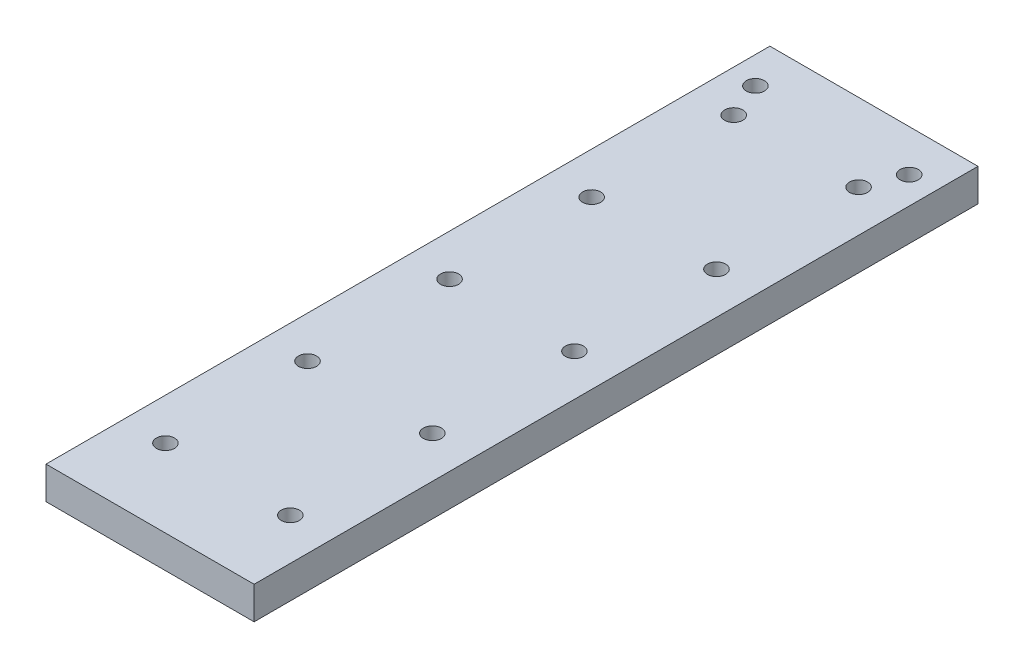
ISO-10303-21;
HEADER;
FILE_DESCRIPTION(('STEP AP214'),'2;1');
FILE_NAME('part.step','',(''),(''),'','','');
FILE_SCHEMA(('AUTOMOTIVE_DESIGN { 1 0 10303 214 1 1 1 1 }'));
ENDSEC;
DATA;
#1=APPLICATION_CONTEXT('core data for automotive mechanical design processes');
#2=APPLICATION_PROTOCOL_DEFINITION('international standard','automotive_design',2000,#1);
#3=PRODUCT_CONTEXT('',#1,'mechanical');
#4=PRODUCT('Part','Part','',(#3));
#5=PRODUCT_RELATED_PRODUCT_CATEGORY('part','',(#4));
#6=PRODUCT_DEFINITION_FORMATION('','',#4);
#7=PRODUCT_DEFINITION_CONTEXT('part definition',#1,'design');
#8=PRODUCT_DEFINITION('design','',#6,#7);
#9=PRODUCT_DEFINITION_SHAPE('','',#8);
#10=(LENGTH_UNIT() NAMED_UNIT(*) SI_UNIT(.MILLI.,.METRE.));
#11=(NAMED_UNIT(*) PLANE_ANGLE_UNIT() SI_UNIT($,.RADIAN.));
#12=(NAMED_UNIT(*) SI_UNIT($,.STERADIAN.) SOLID_ANGLE_UNIT());
#13=UNCERTAINTY_MEASURE_WITH_UNIT(LENGTH_MEASURE(1.E-05),#10,'distance_accuracy_value','');
#14=(GEOMETRIC_REPRESENTATION_CONTEXT(3) GLOBAL_UNCERTAINTY_ASSIGNED_CONTEXT((#13)) GLOBAL_UNIT_ASSIGNED_CONTEXT((#10,
#11,#12)) REPRESENTATION_CONTEXT('',''));
#15=CARTESIAN_POINT('',(0.,0.,0.));
#16=DIRECTION('',(0.,0.,1.));
#17=DIRECTION('',(1.,0.,0.));
#18=AXIS2_PLACEMENT_3D('',#15,#16,#17);
#19=CARTESIAN_POINT('',(57.5,18.,200.));
#20=DIRECTION('',(-1.,0.,0.));
#21=DIRECTION('',(0.,0.,1.));
#22=AXIS2_PLACEMENT_3D('',#19,#20,#21);
#23=PLANE('',#22);
#24=DIRECTION('',(0.,0.,-1.));
#25=VECTOR('',#24,1.);
#26=CARTESIAN_POINT('',(57.5,0.,200.));
#27=LINE('',#26,#25);
#28=CARTESIAN_POINT('',(57.5,0.,200.));
#29=VERTEX_POINT('',#28);
#30=CARTESIAN_POINT('',(57.5,0.,-200.));
#31=VERTEX_POINT('',#30);
#32=EDGE_CURVE('E97',#29,#31,#27,.T.);
#33=ORIENTED_EDGE('',*,*,#32,.T.);
#34=DIRECTION('',(0.,-1.,0.));
#35=VECTOR('',#34,1.);
#36=CARTESIAN_POINT('',(57.5,18.,-200.));
#37=LINE('',#36,#35);
#38=CARTESIAN_POINT('',(57.5,18.,-200.));
#39=VERTEX_POINT('',#38);
#40=EDGE_CURVE('E11',#39,#31,#37,.T.);
#41=ORIENTED_EDGE('',*,*,#40,.F.);
#42=DIRECTION('',(0.,0.,-1.));
#43=VECTOR('',#42,1.);
#44=CARTESIAN_POINT('',(57.5,18.,200.));
#45=LINE('',#44,#43);
#46=CARTESIAN_POINT('',(57.5,18.,200.));
#47=VERTEX_POINT('',#46);
#48=EDGE_CURVE('E85',#47,#39,#45,.T.);
#49=ORIENTED_EDGE('',*,*,#48,.F.);
#50=DIRECTION('',(0.,-1.,0.));
#51=VECTOR('',#50,1.);
#52=CARTESIAN_POINT('',(57.5,18.,200.));
#53=LINE('',#52,#51);
#54=EDGE_CURVE('E93',#47,#29,#53,.T.);
#55=ORIENTED_EDGE('',*,*,#54,.T.);
#56=EDGE_LOOP('',(#33,#41,#49,#55));
#57=FACE_BOUND('',#56,.T.);
#58=ADVANCED_FACE('F34',(#57),#23,.F.);
#59=CARTESIAN_POINT('',(-57.5,18.,-200.));
#60=DIRECTION('',(0.,0.,1.));
#61=DIRECTION('',(1.,0.,0.));
#62=AXIS2_PLACEMENT_3D('',#59,#60,#61);
#63=PLANE('',#62);
#64=DIRECTION('',(-1.,0.,0.));
#65=VECTOR('',#64,1.);
#66=CARTESIAN_POINT('',(-57.5,0.,-200.));
#67=LINE('',#66,#65);
#68=CARTESIAN_POINT('',(-57.5,0.,-200.));
#69=VERTEX_POINT('',#68);
#70=EDGE_CURVE('E89',#31,#69,#67,.T.);
#71=ORIENTED_EDGE('',*,*,#70,.T.);
#72=DIRECTION('',(0.,-1.,0.));
#73=VECTOR('',#72,1.);
#74=CARTESIAN_POINT('',(-57.5,18.,-200.));
#75=LINE('',#74,#73);
#76=CARTESIAN_POINT('',(-57.5,18.,-200.));
#77=VERTEX_POINT('',#76);
#78=EDGE_CURVE('E42',#77,#69,#75,.T.);
#79=ORIENTED_EDGE('',*,*,#78,.F.);
#80=DIRECTION('',(-1.,0.,0.));
#81=VECTOR('',#80,1.);
#82=CARTESIAN_POINT('',(-57.5,18.,-200.));
#83=LINE('',#82,#81);
#84=EDGE_CURVE('E80',#39,#77,#83,.T.);
#85=ORIENTED_EDGE('',*,*,#84,.F.);
#86=ORIENTED_EDGE('',*,*,#40,.T.);
#87=EDGE_LOOP('',(#71,#79,#85,#86));
#88=FACE_BOUND('',#87,.T.);
#89=ADVANCED_FACE('F88',(#88),#63,.F.);
#90=CARTESIAN_POINT('',(-57.5,18.,200.));
#91=DIRECTION('',(1.,0.,0.));
#92=DIRECTION('',(0.,0.,-1.));
#93=AXIS2_PLACEMENT_3D('',#90,#91,#92);
#94=PLANE('',#93);
#95=DIRECTION('',(0.,0.,1.));
#96=VECTOR('',#95,1.);
#97=CARTESIAN_POINT('',(-57.5,0.,200.));
#98=LINE('',#97,#96);
#99=CARTESIAN_POINT('',(-57.5,0.,200.));
#100=VERTEX_POINT('',#99);
#101=EDGE_CURVE('E67',#69,#100,#98,.T.);
#102=ORIENTED_EDGE('',*,*,#101,.T.);
#103=DIRECTION('',(0.,-1.,0.));
#104=VECTOR('',#103,1.);
#105=CARTESIAN_POINT('',(-57.5,18.,200.));
#106=LINE('',#105,#104);
#107=CARTESIAN_POINT('',(-57.5,18.,200.));
#108=VERTEX_POINT('',#107);
#109=EDGE_CURVE('E90',#108,#100,#106,.T.);
#110=ORIENTED_EDGE('',*,*,#109,.F.);
#111=DIRECTION('',(0.,0.,1.));
#112=VECTOR('',#111,1.);
#113=CARTESIAN_POINT('',(-57.5,18.,200.));
#114=LINE('',#113,#112);
#115=EDGE_CURVE('E83',#77,#108,#114,.T.);
#116=ORIENTED_EDGE('',*,*,#115,.F.);
#117=ORIENTED_EDGE('',*,*,#78,.T.);
#118=EDGE_LOOP('',(#102,#110,#116,#117));
#119=FACE_BOUND('',#118,.T.);
#120=ADVANCED_FACE('F91',(#119),#94,.F.);
#121=CARTESIAN_POINT('',(-57.5,18.,200.));
#122=DIRECTION('',(0.,0.,-1.));
#123=DIRECTION('',(-1.,0.,0.));
#124=AXIS2_PLACEMENT_3D('',#121,#122,#123);
#125=PLANE('',#124);
#126=DIRECTION('',(1.,0.,0.));
#127=VECTOR('',#126,1.);
#128=CARTESIAN_POINT('',(-57.5,0.,200.));
#129=LINE('',#128,#127);
#130=EDGE_CURVE('E73',#100,#29,#129,.T.);
#131=ORIENTED_EDGE('',*,*,#130,.T.);
#132=ORIENTED_EDGE('',*,*,#54,.F.);
#133=DIRECTION('',(1.,0.,0.));
#134=VECTOR('',#133,1.);
#135=CARTESIAN_POINT('',(-57.5,18.,200.));
#136=LINE('',#135,#134);
#137=EDGE_CURVE('E50',#108,#47,#136,.T.);
#138=ORIENTED_EDGE('',*,*,#137,.F.);
#139=ORIENTED_EDGE('',*,*,#109,.T.);
#140=EDGE_LOOP('',(#131,#132,#138,#139));
#141=FACE_BOUND('',#140,.T.);
#142=ADVANCED_FACE('F105',(#141),#125,.F.);
#143=CARTESIAN_POINT('',(0.,18.,0.));
#144=DIRECTION('',(0.,-1.,0.));
#145=DIRECTION('',(0.,0.,-1.));
#146=AXIS2_PLACEMENT_3D('',#143,#144,#145);
#147=PLANE('',#146);
#148=CARTESIAN_POINT('',(-34.5,18.,-157.));
#149=DIRECTION('',(0.,1.,0.));
#150=DIRECTION('',(0.,0.,-1.));
#151=AXIS2_PLACEMENT_3D('',#148,#149,#150);
#152=CIRCLE('',#151,5.);
#153=CARTESIAN_POINT('',(-34.5,18.,-162.));
#154=VERTEX_POINT('',#153);
#155=EDGE_CURVE('E147',#154,#154,#152,.T.);
#156=ORIENTED_EDGE('',*,*,#155,.F.);
#157=EDGE_LOOP('',(#156));
#158=FACE_BOUND('',#157,.T.);
#159=CARTESIAN_POINT('',(-34.5,18.,-78.5));
#160=DIRECTION('',(0.,1.,0.));
#161=DIRECTION('',(0.,0.,-1.));
#162=AXIS2_PLACEMENT_3D('',#159,#160,#161);
#163=CIRCLE('',#162,5.);
#164=CARTESIAN_POINT('',(-34.5,18.,-83.5));
#165=VERTEX_POINT('',#164);
#166=EDGE_CURVE('E153',#165,#165,#163,.T.);
#167=ORIENTED_EDGE('',*,*,#166,.F.);
#168=EDGE_LOOP('',(#167));
#169=FACE_BOUND('',#168,.T.);
#170=CARTESIAN_POINT('',(-34.5,18.,0.));
#171=DIRECTION('',(0.,1.,0.));
#172=DIRECTION('',(0.,0.,-1.));
#173=AXIS2_PLACEMENT_3D('',#170,#171,#172);
#174=CIRCLE('',#173,5.);
#175=CARTESIAN_POINT('',(-34.5,18.,-5.));
#176=VERTEX_POINT('',#175);
#177=EDGE_CURVE('E159',#176,#176,#174,.T.);
#178=ORIENTED_EDGE('',*,*,#177,.F.);
#179=EDGE_LOOP('',(#178));
#180=FACE_BOUND('',#179,.T.);
#181=CARTESIAN_POINT('',(-34.5,18.,78.5));
#182=DIRECTION('',(0.,1.,0.));
#183=DIRECTION('',(0.,0.,1.));
#184=AXIS2_PLACEMENT_3D('',#181,#182,#183);
#185=CIRCLE('',#184,5.);
#186=CARTESIAN_POINT('',(-34.5,18.,83.5));
#187=VERTEX_POINT('',#186);
#188=EDGE_CURVE('E165',#187,#187,#185,.T.);
#189=ORIENTED_EDGE('',*,*,#188,.F.);
#190=EDGE_LOOP('',(#189));
#191=FACE_BOUND('',#190,.T.);
#192=CARTESIAN_POINT('',(-34.5,18.,157.));
#193=DIRECTION('',(0.,1.,0.));
#194=DIRECTION('',(0.,0.,1.));
#195=AXIS2_PLACEMENT_3D('',#192,#193,#194);
#196=CIRCLE('',#195,5.);
#197=CARTESIAN_POINT('',(-34.5,18.,162.));
#198=VERTEX_POINT('',#197);
#199=EDGE_CURVE('E171',#198,#198,#196,.T.);
#200=ORIENTED_EDGE('',*,*,#199,.F.);
#201=EDGE_LOOP('',(#200));
#202=FACE_BOUND('',#201,.T.);
#203=CARTESIAN_POINT('',(34.5,18.,157.));
#204=DIRECTION('',(0.,1.,0.));
#205=DIRECTION('',(0.,0.,-1.));
#206=AXIS2_PLACEMENT_3D('',#203,#204,#205);
#207=CIRCLE('',#206,5.);
#208=CARTESIAN_POINT('',(34.5,18.,152.));
#209=VERTEX_POINT('',#208);
#210=EDGE_CURVE('E177',#209,#209,#207,.T.);
#211=ORIENTED_EDGE('',*,*,#210,.F.);
#212=EDGE_LOOP('',(#211));
#213=FACE_BOUND('',#212,.T.);
#214=CARTESIAN_POINT('',(34.5,18.,78.5));
#215=DIRECTION('',(0.,1.,0.));
#216=DIRECTION('',(0.,0.,-1.));
#217=AXIS2_PLACEMENT_3D('',#214,#215,#216);
#218=CIRCLE('',#217,5.);
#219=CARTESIAN_POINT('',(34.5,18.,73.5));
#220=VERTEX_POINT('',#219);
#221=EDGE_CURVE('E117',#220,#220,#218,.T.);
#222=ORIENTED_EDGE('',*,*,#221,.F.);
#223=EDGE_LOOP('',(#222));
#224=FACE_BOUND('',#223,.T.);
#225=CARTESIAN_POINT('',(34.5,18.,0.));
#226=DIRECTION('',(0.,1.,0.));
#227=DIRECTION('',(0.,0.,1.));
#228=AXIS2_PLACEMENT_3D('',#225,#226,#227);
#229=CIRCLE('',#228,5.);
#230=CARTESIAN_POINT('',(34.5,18.,5.));
#231=VERTEX_POINT('',#230);
#232=EDGE_CURVE('E124',#231,#231,#229,.T.);
#233=ORIENTED_EDGE('',*,*,#232,.F.);
#234=EDGE_LOOP('',(#233));
#235=FACE_BOUND('',#234,.T.);
#236=CARTESIAN_POINT('',(34.5,18.,-78.5));
#237=DIRECTION('',(0.,1.,0.));
#238=DIRECTION('',(0.,0.,1.));
#239=AXIS2_PLACEMENT_3D('',#236,#237,#238);
#240=CIRCLE('',#239,5.);
#241=CARTESIAN_POINT('',(34.5,18.,-73.5));
#242=VERTEX_POINT('',#241);
#243=EDGE_CURVE('E130',#242,#242,#240,.T.);
#244=ORIENTED_EDGE('',*,*,#243,.F.);
#245=EDGE_LOOP('',(#244));
#246=FACE_BOUND('',#245,.T.);
#247=CARTESIAN_POINT('',(34.5,18.,-157.));
#248=DIRECTION('',(0.,1.,0.));
#249=DIRECTION('',(0.,0.,1.));
#250=AXIS2_PLACEMENT_3D('',#247,#248,#249);
#251=CIRCLE('',#250,5.);
#252=CARTESIAN_POINT('',(34.5,18.,-152.));
#253=VERTEX_POINT('',#252);
#254=EDGE_CURVE('E136',#253,#253,#251,.T.);
#255=ORIENTED_EDGE('',*,*,#254,.F.);
#256=EDGE_LOOP('',(#255));
#257=FACE_BOUND('',#256,.T.);
#258=CARTESIAN_POINT('',(42.5,18.,-177.));
#259=DIRECTION('',(0.,1.,0.));
#260=DIRECTION('',(0.,0.,-1.));
#261=AXIS2_PLACEMENT_3D('',#258,#259,#260);
#262=CIRCLE('',#261,5.00000000000001);
#263=CARTESIAN_POINT('',(42.5,18.,-182.));
#264=VERTEX_POINT('',#263);
#265=EDGE_CURVE('E142',#264,#264,#262,.T.);
#266=ORIENTED_EDGE('',*,*,#265,.F.);
#267=EDGE_LOOP('',(#266));
#268=FACE_BOUND('',#267,.T.);
#269=CARTESIAN_POINT('',(-42.5,18.,-177.));
#270=DIRECTION('',(0.,1.,0.));
#271=DIRECTION('',(0.,0.,1.));
#272=AXIS2_PLACEMENT_3D('',#269,#270,#271);
#273=CIRCLE('',#272,5.00000000000001);
#274=CARTESIAN_POINT('',(-42.5,18.,-172.));
#275=VERTEX_POINT('',#274);
#276=EDGE_CURVE('E111',#275,#275,#273,.T.);
#277=ORIENTED_EDGE('',*,*,#276,.F.);
#278=EDGE_LOOP('',(#277));
#279=FACE_BOUND('',#278,.T.);
#280=ORIENTED_EDGE('',*,*,#48,.T.);
#281=ORIENTED_EDGE('',*,*,#84,.T.);
#282=ORIENTED_EDGE('',*,*,#115,.T.);
#283=ORIENTED_EDGE('',*,*,#137,.T.);
#284=EDGE_LOOP('',(#280,#281,#282,#283));
#285=FACE_BOUND('',#284,.T.);
#286=ADVANCED_FACE('F81',(#158,#169,#180,#191,#202,#213,#224,#235,#246,#257,#268,#279,#285),
#147,.F.);
#287=CARTESIAN_POINT('',(0.,0.,0.));
#288=DIRECTION('',(0.,-1.,0.));
#289=DIRECTION('',(0.,0.,-1.));
#290=AXIS2_PLACEMENT_3D('',#287,#288,#289);
#291=PLANE('',#290);
#292=CARTESIAN_POINT('',(-34.5,0.,-157.));
#293=DIRECTION('',(0.,1.,0.));
#294=DIRECTION('',(0.,0.,-1.));
#295=AXIS2_PLACEMENT_3D('',#292,#293,#294);
#296=CIRCLE('',#295,5.);
#297=CARTESIAN_POINT('',(-34.5,0.,-162.));
#298=VERTEX_POINT('',#297);
#299=EDGE_CURVE('E150',#298,#298,#296,.T.);
#300=ORIENTED_EDGE('',*,*,#299,.T.);
#301=EDGE_LOOP('',(#300));
#302=FACE_BOUND('',#301,.T.);
#303=CARTESIAN_POINT('',(-34.5,0.,-78.5));
#304=DIRECTION('',(0.,1.,0.));
#305=DIRECTION('',(0.,0.,-1.));
#306=AXIS2_PLACEMENT_3D('',#303,#304,#305);
#307=CIRCLE('',#306,5.);
#308=CARTESIAN_POINT('',(-34.5,0.,-83.5));
#309=VERTEX_POINT('',#308);
#310=EDGE_CURVE('E156',#309,#309,#307,.T.);
#311=ORIENTED_EDGE('',*,*,#310,.T.);
#312=EDGE_LOOP('',(#311));
#313=FACE_BOUND('',#312,.T.);
#314=CARTESIAN_POINT('',(-34.5,0.,0.));
#315=DIRECTION('',(0.,1.,0.));
#316=DIRECTION('',(0.,0.,-1.));
#317=AXIS2_PLACEMENT_3D('',#314,#315,#316);
#318=CIRCLE('',#317,5.);
#319=CARTESIAN_POINT('',(-34.5,0.,-5.));
#320=VERTEX_POINT('',#319);
#321=EDGE_CURVE('E162',#320,#320,#318,.T.);
#322=ORIENTED_EDGE('',*,*,#321,.T.);
#323=EDGE_LOOP('',(#322));
#324=FACE_BOUND('',#323,.T.);
#325=CARTESIAN_POINT('',(-34.5,0.,78.5));
#326=DIRECTION('',(0.,1.,0.));
#327=DIRECTION('',(0.,0.,1.));
#328=AXIS2_PLACEMENT_3D('',#325,#326,#327);
#329=CIRCLE('',#328,5.);
#330=CARTESIAN_POINT('',(-34.5,0.,83.5));
#331=VERTEX_POINT('',#330);
#332=EDGE_CURVE('E168',#331,#331,#329,.T.);
#333=ORIENTED_EDGE('',*,*,#332,.T.);
#334=EDGE_LOOP('',(#333));
#335=FACE_BOUND('',#334,.T.);
#336=CARTESIAN_POINT('',(-34.5,0.,157.));
#337=DIRECTION('',(0.,1.,0.));
#338=DIRECTION('',(0.,0.,1.));
#339=AXIS2_PLACEMENT_3D('',#336,#337,#338);
#340=CIRCLE('',#339,5.);
#341=CARTESIAN_POINT('',(-34.5,0.,162.));
#342=VERTEX_POINT('',#341);
#343=EDGE_CURVE('E174',#342,#342,#340,.T.);
#344=ORIENTED_EDGE('',*,*,#343,.T.);
#345=EDGE_LOOP('',(#344));
#346=FACE_BOUND('',#345,.T.);
#347=CARTESIAN_POINT('',(34.5,0.,157.));
#348=DIRECTION('',(0.,1.,0.));
#349=DIRECTION('',(0.,0.,-1.));
#350=AXIS2_PLACEMENT_3D('',#347,#348,#349);
#351=CIRCLE('',#350,5.);
#352=CARTESIAN_POINT('',(34.5,0.,152.));
#353=VERTEX_POINT('',#352);
#354=EDGE_CURVE('E121',#353,#353,#351,.T.);
#355=ORIENTED_EDGE('',*,*,#354,.T.);
#356=EDGE_LOOP('',(#355));
#357=FACE_BOUND('',#356,.T.);
#358=CARTESIAN_POINT('',(34.5,0.,78.5));
#359=DIRECTION('',(0.,1.,0.));
#360=DIRECTION('',(0.,0.,-1.));
#361=AXIS2_PLACEMENT_3D('',#358,#359,#360);
#362=CIRCLE('',#361,5.);
#363=CARTESIAN_POINT('',(34.5,0.,73.5));
#364=VERTEX_POINT('',#363);
#365=EDGE_CURVE('E120',#364,#364,#362,.T.);
#366=ORIENTED_EDGE('',*,*,#365,.T.);
#367=EDGE_LOOP('',(#366));
#368=FACE_BOUND('',#367,.T.);
#369=CARTESIAN_POINT('',(34.5,0.,0.));
#370=DIRECTION('',(0.,1.,0.));
#371=DIRECTION('',(0.,0.,1.));
#372=AXIS2_PLACEMENT_3D('',#369,#370,#371);
#373=CIRCLE('',#372,5.);
#374=CARTESIAN_POINT('',(34.5,0.,5.));
#375=VERTEX_POINT('',#374);
#376=EDGE_CURVE('E127',#375,#375,#373,.T.);
#377=ORIENTED_EDGE('',*,*,#376,.T.);
#378=EDGE_LOOP('',(#377));
#379=FACE_BOUND('',#378,.T.);
#380=CARTESIAN_POINT('',(34.5,0.,-78.5));
#381=DIRECTION('',(0.,1.,0.));
#382=DIRECTION('',(0.,0.,1.));
#383=AXIS2_PLACEMENT_3D('',#380,#381,#382);
#384=CIRCLE('',#383,5.);
#385=CARTESIAN_POINT('',(34.5,0.,-73.5));
#386=VERTEX_POINT('',#385);
#387=EDGE_CURVE('E133',#386,#386,#384,.T.);
#388=ORIENTED_EDGE('',*,*,#387,.T.);
#389=EDGE_LOOP('',(#388));
#390=FACE_BOUND('',#389,.T.);
#391=CARTESIAN_POINT('',(34.5,0.,-157.));
#392=DIRECTION('',(0.,1.,0.));
#393=DIRECTION('',(0.,0.,1.));
#394=AXIS2_PLACEMENT_3D('',#391,#392,#393);
#395=CIRCLE('',#394,5.);
#396=CARTESIAN_POINT('',(34.5,0.,-152.));
#397=VERTEX_POINT('',#396);
#398=EDGE_CURVE('E139',#397,#397,#395,.T.);
#399=ORIENTED_EDGE('',*,*,#398,.T.);
#400=EDGE_LOOP('',(#399));
#401=FACE_BOUND('',#400,.T.);
#402=CARTESIAN_POINT('',(42.5,0.,-177.));
#403=DIRECTION('',(0.,1.,0.));
#404=DIRECTION('',(0.,0.,-1.));
#405=AXIS2_PLACEMENT_3D('',#402,#403,#404);
#406=CIRCLE('',#405,5.00000000000001);
#407=CARTESIAN_POINT('',(42.5,0.,-182.));
#408=VERTEX_POINT('',#407);
#409=EDGE_CURVE('E114',#408,#408,#406,.T.);
#410=ORIENTED_EDGE('',*,*,#409,.T.);
#411=EDGE_LOOP('',(#410));
#412=FACE_BOUND('',#411,.T.);
#413=CARTESIAN_POINT('',(-42.5,0.,-177.));
#414=DIRECTION('',(0.,1.,0.));
#415=DIRECTION('',(0.,0.,1.));
#416=AXIS2_PLACEMENT_3D('',#413,#414,#415);
#417=CIRCLE('',#416,5.00000000000001);
#418=CARTESIAN_POINT('',(-42.5,0.,-172.));
#419=VERTEX_POINT('',#418);
#420=EDGE_CURVE('E100',#419,#419,#417,.T.);
#421=ORIENTED_EDGE('',*,*,#420,.T.);
#422=EDGE_LOOP('',(#421));
#423=FACE_BOUND('',#422,.T.);
#424=ORIENTED_EDGE('',*,*,#32,.F.);
#425=ORIENTED_EDGE('',*,*,#130,.F.);
#426=ORIENTED_EDGE('',*,*,#101,.F.);
#427=ORIENTED_EDGE('',*,*,#70,.F.);
#428=EDGE_LOOP('',(#424,#425,#426,#427));
#429=FACE_BOUND('',#428,.T.);
#430=ADVANCED_FACE('F108',(#302,#313,#324,#335,#346,#357,#368,#379,#390,#401,#412,#423,#429),
#291,.T.);
#431=CARTESIAN_POINT('',(-42.5,0.,-177.));
#432=DIRECTION('',(0.,1.,0.));
#433=DIRECTION('',(0.,0.,1.));
#434=AXIS2_PLACEMENT_3D('',#431,#432,#433);
#435=CYLINDRICAL_SURFACE('',#434,5.00000000000001);
#436=ORIENTED_EDGE('',*,*,#420,.F.);
#437=EDGE_LOOP('',(#436));
#438=FACE_BOUND('',#437,.T.);
#439=ORIENTED_EDGE('',*,*,#276,.T.);
#440=EDGE_LOOP('',(#439));
#441=FACE_BOUND('',#440,.T.);
#442=ADVANCED_FACE('F209',(#438,#441),#435,.F.);
#443=CARTESIAN_POINT('',(42.5,0.,-177.));
#444=DIRECTION('',(0.,1.,0.));
#445=DIRECTION('',(0.,0.,1.));
#446=AXIS2_PLACEMENT_3D('',#443,#444,#445);
#447=CYLINDRICAL_SURFACE('',#446,5.00000000000001);
#448=ORIENTED_EDGE('',*,*,#409,.F.);
#449=EDGE_LOOP('',(#448));
#450=FACE_BOUND('',#449,.T.);
#451=ORIENTED_EDGE('',*,*,#265,.T.);
#452=EDGE_LOOP('',(#451));
#453=FACE_BOUND('',#452,.T.);
#454=ADVANCED_FACE('F211',(#450,#453),#447,.F.);
#455=CARTESIAN_POINT('',(34.5,0.,-157.));
#456=DIRECTION('',(0.,1.,0.));
#457=DIRECTION('',(0.,0.,1.));
#458=AXIS2_PLACEMENT_3D('',#455,#456,#457);
#459=CYLINDRICAL_SURFACE('',#458,5.);
#460=ORIENTED_EDGE('',*,*,#398,.F.);
#461=EDGE_LOOP('',(#460));
#462=FACE_BOUND('',#461,.T.);
#463=ORIENTED_EDGE('',*,*,#254,.T.);
#464=EDGE_LOOP('',(#463));
#465=FACE_BOUND('',#464,.T.);
#466=ADVANCED_FACE('F218',(#462,#465),#459,.F.);
#467=CARTESIAN_POINT('',(34.5,0.,-78.5));
#468=DIRECTION('',(0.,1.,0.));
#469=DIRECTION('',(0.,0.,1.));
#470=AXIS2_PLACEMENT_3D('',#467,#468,#469);
#471=CYLINDRICAL_SURFACE('',#470,5.);
#472=ORIENTED_EDGE('',*,*,#387,.F.);
#473=EDGE_LOOP('',(#472));
#474=FACE_BOUND('',#473,.T.);
#475=ORIENTED_EDGE('',*,*,#243,.T.);
#476=EDGE_LOOP('',(#475));
#477=FACE_BOUND('',#476,.T.);
#478=ADVANCED_FACE('F266',(#474,#477),#471,.F.);
#479=CARTESIAN_POINT('',(34.5,0.,0.));
#480=DIRECTION('',(0.,1.,0.));
#481=DIRECTION('',(0.,0.,1.));
#482=AXIS2_PLACEMENT_3D('',#479,#480,#481);
#483=CYLINDRICAL_SURFACE('',#482,5.);
#484=ORIENTED_EDGE('',*,*,#376,.F.);
#485=EDGE_LOOP('',(#484));
#486=FACE_BOUND('',#485,.T.);
#487=ORIENTED_EDGE('',*,*,#232,.T.);
#488=EDGE_LOOP('',(#487));
#489=FACE_BOUND('',#488,.T.);
#490=ADVANCED_FACE('F276',(#486,#489),#483,.F.);
#491=CARTESIAN_POINT('',(34.5,0.,78.5));
#492=DIRECTION('',(0.,1.,0.));
#493=DIRECTION('',(0.,0.,1.));
#494=AXIS2_PLACEMENT_3D('',#491,#492,#493);
#495=CYLINDRICAL_SURFACE('',#494,5.);
#496=ORIENTED_EDGE('',*,*,#365,.F.);
#497=EDGE_LOOP('',(#496));
#498=FACE_BOUND('',#497,.T.);
#499=ORIENTED_EDGE('',*,*,#221,.T.);
#500=EDGE_LOOP('',(#499));
#501=FACE_BOUND('',#500,.T.);
#502=ADVANCED_FACE('F189',(#498,#501),#495,.F.);
#503=CARTESIAN_POINT('',(34.5,0.,157.));
#504=DIRECTION('',(0.,1.,0.));
#505=DIRECTION('',(0.,0.,1.));
#506=AXIS2_PLACEMENT_3D('',#503,#504,#505);
#507=CYLINDRICAL_SURFACE('',#506,5.);
#508=ORIENTED_EDGE('',*,*,#354,.F.);
#509=EDGE_LOOP('',(#508));
#510=FACE_BOUND('',#509,.T.);
#511=ORIENTED_EDGE('',*,*,#210,.T.);
#512=EDGE_LOOP('',(#511));
#513=FACE_BOUND('',#512,.T.);
#514=ADVANCED_FACE('F185',(#510,#513),#507,.F.);
#515=CARTESIAN_POINT('',(-34.5,0.,157.));
#516=DIRECTION('',(0.,1.,0.));
#517=DIRECTION('',(0.,0.,1.));
#518=AXIS2_PLACEMENT_3D('',#515,#516,#517);
#519=CYLINDRICAL_SURFACE('',#518,5.);
#520=ORIENTED_EDGE('',*,*,#343,.F.);
#521=EDGE_LOOP('',(#520));
#522=FACE_BOUND('',#521,.T.);
#523=ORIENTED_EDGE('',*,*,#199,.T.);
#524=EDGE_LOOP('',(#523));
#525=FACE_BOUND('',#524,.T.);
#526=ADVANCED_FACE('F188',(#522,#525),#519,.F.);
#527=CARTESIAN_POINT('',(-34.5,0.,78.5));
#528=DIRECTION('',(0.,1.,0.));
#529=DIRECTION('',(0.,0.,1.));
#530=AXIS2_PLACEMENT_3D('',#527,#528,#529);
#531=CYLINDRICAL_SURFACE('',#530,5.);
#532=ORIENTED_EDGE('',*,*,#332,.F.);
#533=EDGE_LOOP('',(#532));
#534=FACE_BOUND('',#533,.T.);
#535=ORIENTED_EDGE('',*,*,#188,.T.);
#536=EDGE_LOOP('',(#535));
#537=FACE_BOUND('',#536,.T.);
#538=ADVANCED_FACE('F309',(#534,#537),#531,.F.);
#539=CARTESIAN_POINT('',(-34.5,0.,0.));
#540=DIRECTION('',(0.,1.,0.));
#541=DIRECTION('',(0.,0.,1.));
#542=AXIS2_PLACEMENT_3D('',#539,#540,#541);
#543=CYLINDRICAL_SURFACE('',#542,5.);
#544=ORIENTED_EDGE('',*,*,#321,.F.);
#545=EDGE_LOOP('',(#544));
#546=FACE_BOUND('',#545,.T.);
#547=ORIENTED_EDGE('',*,*,#177,.T.);
#548=EDGE_LOOP('',(#547));
#549=FACE_BOUND('',#548,.T.);
#550=ADVANCED_FACE('F319',(#546,#549),#543,.F.);
#551=CARTESIAN_POINT('',(-34.5,0.,-78.5));
#552=DIRECTION('',(0.,1.,0.));
#553=DIRECTION('',(0.,0.,1.));
#554=AXIS2_PLACEMENT_3D('',#551,#552,#553);
#555=CYLINDRICAL_SURFACE('',#554,5.);
#556=ORIENTED_EDGE('',*,*,#310,.F.);
#557=EDGE_LOOP('',(#556));
#558=FACE_BOUND('',#557,.T.);
#559=ORIENTED_EDGE('',*,*,#166,.T.);
#560=EDGE_LOOP('',(#559));
#561=FACE_BOUND('',#560,.T.);
#562=ADVANCED_FACE('F329',(#558,#561),#555,.F.);
#563=CARTESIAN_POINT('',(-34.5,0.,-157.));
#564=DIRECTION('',(0.,1.,0.));
#565=DIRECTION('',(0.,0.,1.));
#566=AXIS2_PLACEMENT_3D('',#563,#564,#565);
#567=CYLINDRICAL_SURFACE('',#566,5.);
#568=ORIENTED_EDGE('',*,*,#299,.F.);
#569=EDGE_LOOP('',(#568));
#570=FACE_BOUND('',#569,.T.);
#571=ORIENTED_EDGE('',*,*,#155,.T.);
#572=EDGE_LOOP('',(#571));
#573=FACE_BOUND('',#572,.T.);
#574=ADVANCED_FACE('F339',(#570,#573),#567,.F.);
#575=CLOSED_SHELL('',(#58,#89,#120,#142,#286,#430,#442,#454,#466,#478,#490,#502,#514,#526,#538,
#550,#562,#574));
#576=MANIFOLD_SOLID_BREP('B2',#575);
#577=ADVANCED_BREP_SHAPE_REPRESENTATION('',(#18,#576),#14);
#578=SHAPE_DEFINITION_REPRESENTATION(#9,#577);
ENDSEC;
END-ISO-10303-21;
